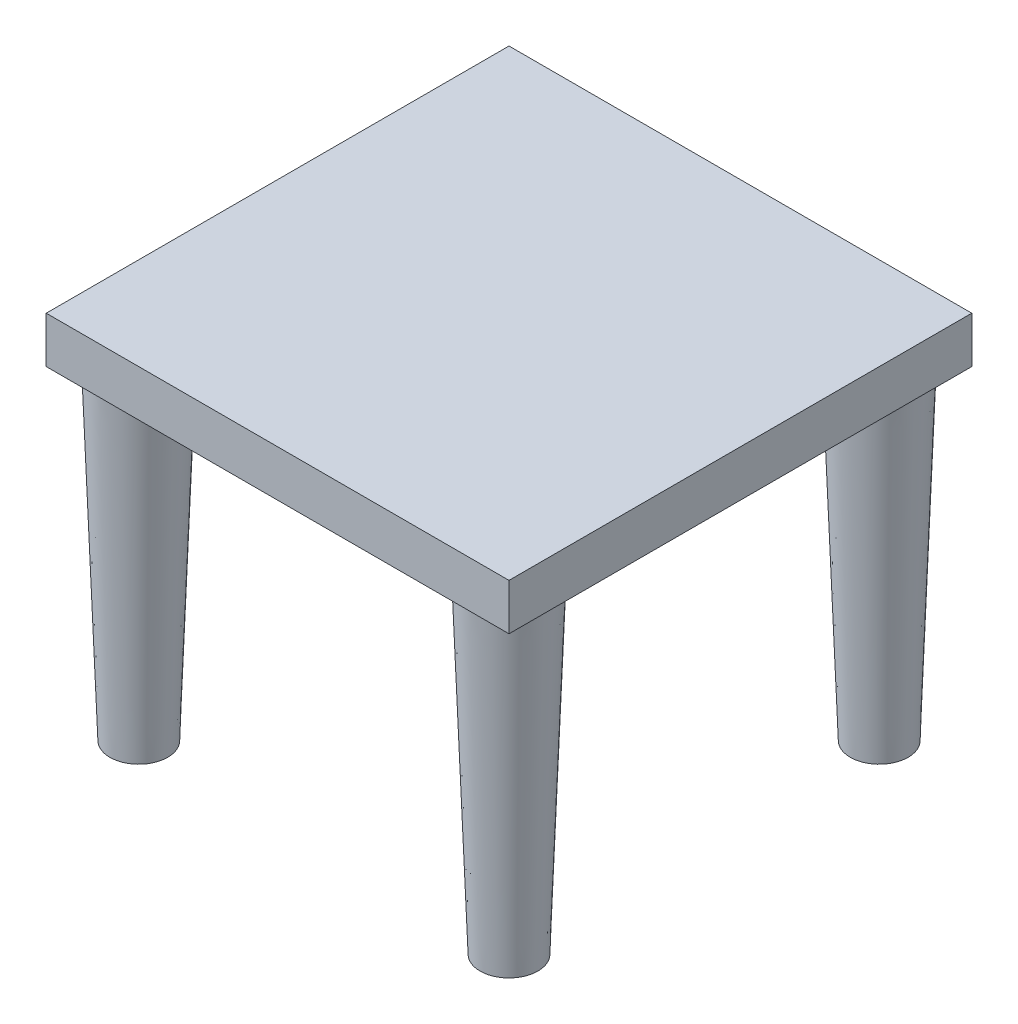
ISO-10303-21;
HEADER;
FILE_DESCRIPTION(('STEP AP214'),'2;1');
FILE_NAME('part.step','',(''),(''),'','','');
FILE_SCHEMA(('AUTOMOTIVE_DESIGN { 1 0 10303 214 1 1 1 1 }'));
ENDSEC;
DATA;
#1=APPLICATION_CONTEXT('core data for automotive mechanical design processes');
#2=APPLICATION_PROTOCOL_DEFINITION('international standard','automotive_design',2000,#1);
#3=PRODUCT_CONTEXT('',#1,'mechanical');
#4=PRODUCT('Part','Part','',(#3));
#5=PRODUCT_RELATED_PRODUCT_CATEGORY('part','',(#4));
#6=PRODUCT_DEFINITION_FORMATION('','',#4);
#7=PRODUCT_DEFINITION_CONTEXT('part definition',#1,'design');
#8=PRODUCT_DEFINITION('design','',#6,#7);
#9=PRODUCT_DEFINITION_SHAPE('','',#8);
#10=(LENGTH_UNIT() NAMED_UNIT(*) SI_UNIT(.MILLI.,.METRE.));
#11=(NAMED_UNIT(*) PLANE_ANGLE_UNIT() SI_UNIT($,.RADIAN.));
#12=(NAMED_UNIT(*) SI_UNIT($,.STERADIAN.) SOLID_ANGLE_UNIT());
#13=UNCERTAINTY_MEASURE_WITH_UNIT(LENGTH_MEASURE(1.E-05),#10,'distance_accuracy_value','');
#14=(GEOMETRIC_REPRESENTATION_CONTEXT(3) GLOBAL_UNCERTAINTY_ASSIGNED_CONTEXT((#13)) GLOBAL_UNIT_ASSIGNED_CONTEXT((#10,
#11,#12)) REPRESENTATION_CONTEXT('',''));
#15=CARTESIAN_POINT('',(0.,0.,0.));
#16=DIRECTION('',(0.,0.,1.));
#17=DIRECTION('',(1.,0.,0.));
#18=AXIS2_PLACEMENT_3D('',#15,#16,#17);
#19=CARTESIAN_POINT('',(50.,5.,-50.));
#20=DIRECTION('',(-1.,0.,0.));
#21=DIRECTION('',(0.,0.,1.));
#22=AXIS2_PLACEMENT_3D('',#19,#20,#21);
#23=PLANE('',#22);
#24=DIRECTION('',(0.,0.,-1.));
#25=VECTOR('',#24,1.);
#26=CARTESIAN_POINT('',(50.,-5.,-50.));
#27=LINE('',#26,#25);
#28=CARTESIAN_POINT('',(50.,-5.,50.));
#29=VERTEX_POINT('',#28);
#30=CARTESIAN_POINT('',(50.,-5.,-50.));
#31=VERTEX_POINT('',#30);
#32=EDGE_CURVE('E115',#29,#31,#27,.T.);
#33=ORIENTED_EDGE('',*,*,#32,.T.);
#34=DIRECTION('',(0.,-1.,0.));
#35=VECTOR('',#34,1.);
#36=CARTESIAN_POINT('',(50.,5.,-50.));
#37=LINE('',#36,#35);
#38=CARTESIAN_POINT('',(50.,5.,-50.));
#39=VERTEX_POINT('',#38);
#40=EDGE_CURVE('E12',#39,#31,#37,.T.);
#41=ORIENTED_EDGE('',*,*,#40,.F.);
#42=DIRECTION('',(0.,0.,-1.));
#43=VECTOR('',#42,1.);
#44=CARTESIAN_POINT('',(50.,5.,-50.));
#45=LINE('',#44,#43);
#46=CARTESIAN_POINT('',(50.,5.,50.));
#47=VERTEX_POINT('',#46);
#48=EDGE_CURVE('E99',#47,#39,#45,.T.);
#49=ORIENTED_EDGE('',*,*,#48,.F.);
#50=DIRECTION('',(0.,-1.,0.));
#51=VECTOR('',#50,1.);
#52=CARTESIAN_POINT('',(50.,5.,50.));
#53=LINE('',#52,#51);
#54=EDGE_CURVE('E111',#47,#29,#53,.T.);
#55=ORIENTED_EDGE('',*,*,#54,.T.);
#56=EDGE_LOOP('',(#33,#41,#49,#55));
#57=FACE_BOUND('',#56,.T.);
#58=ADVANCED_FACE('F47',(#57),#23,.F.);
#59=CARTESIAN_POINT('',(-50.,5.,-50.));
#60=DIRECTION('',(0.,0.,1.));
#61=DIRECTION('',(1.,0.,0.));
#62=AXIS2_PLACEMENT_3D('',#59,#60,#61);
#63=PLANE('',#62);
#64=DIRECTION('',(-1.,0.,0.));
#65=VECTOR('',#64,1.);
#66=CARTESIAN_POINT('',(-50.,-5.,-50.));
#67=LINE('',#66,#65);
#68=CARTESIAN_POINT('',(-50.,-5.,-50.));
#69=VERTEX_POINT('',#68);
#70=EDGE_CURVE('E104',#31,#69,#67,.T.);
#71=ORIENTED_EDGE('',*,*,#70,.T.);
#72=DIRECTION('',(0.,-1.,0.));
#73=VECTOR('',#72,1.);
#74=CARTESIAN_POINT('',(-50.,5.,-50.));
#75=LINE('',#74,#73);
#76=CARTESIAN_POINT('',(-50.,5.,-50.));
#77=VERTEX_POINT('',#76);
#78=EDGE_CURVE('E56',#77,#69,#75,.T.);
#79=ORIENTED_EDGE('',*,*,#78,.F.);
#80=DIRECTION('',(-1.,0.,0.));
#81=VECTOR('',#80,1.);
#82=CARTESIAN_POINT('',(-50.,5.,-50.));
#83=LINE('',#82,#81);
#84=EDGE_CURVE('E94',#39,#77,#83,.T.);
#85=ORIENTED_EDGE('',*,*,#84,.F.);
#86=ORIENTED_EDGE('',*,*,#40,.T.);
#87=EDGE_LOOP('',(#71,#79,#85,#86));
#88=FACE_BOUND('',#87,.T.);
#89=ADVANCED_FACE('F103',(#88),#63,.F.);
#90=CARTESIAN_POINT('',(-50.,5.,-50.));
#91=DIRECTION('',(1.,0.,0.));
#92=DIRECTION('',(0.,0.,-1.));
#93=AXIS2_PLACEMENT_3D('',#90,#91,#92);
#94=PLANE('',#93);
#95=DIRECTION('',(0.,0.,1.));
#96=VECTOR('',#95,1.);
#97=CARTESIAN_POINT('',(-50.,-5.,-50.));
#98=LINE('',#97,#96);
#99=CARTESIAN_POINT('',(-50.,-5.,50.));
#100=VERTEX_POINT('',#99);
#101=EDGE_CURVE('E81',#69,#100,#98,.T.);
#102=ORIENTED_EDGE('',*,*,#101,.T.);
#103=DIRECTION('',(0.,-1.,0.));
#104=VECTOR('',#103,1.);
#105=CARTESIAN_POINT('',(-50.,5.,50.));
#106=LINE('',#105,#104);
#107=CARTESIAN_POINT('',(-50.,5.,50.));
#108=VERTEX_POINT('',#107);
#109=EDGE_CURVE('E106',#108,#100,#106,.T.);
#110=ORIENTED_EDGE('',*,*,#109,.F.);
#111=DIRECTION('',(0.,0.,1.));
#112=VECTOR('',#111,1.);
#113=CARTESIAN_POINT('',(-50.,5.,-50.));
#114=LINE('',#113,#112);
#115=EDGE_CURVE('E97',#77,#108,#114,.T.);
#116=ORIENTED_EDGE('',*,*,#115,.F.);
#117=ORIENTED_EDGE('',*,*,#78,.T.);
#118=EDGE_LOOP('',(#102,#110,#116,#117));
#119=FACE_BOUND('',#118,.T.);
#120=ADVANCED_FACE('F107',(#119),#94,.F.);
#121=CARTESIAN_POINT('',(-50.,5.,50.));
#122=DIRECTION('',(0.,0.,-1.));
#123=DIRECTION('',(-1.,0.,0.));
#124=AXIS2_PLACEMENT_3D('',#121,#122,#123);
#125=PLANE('',#124);
#126=DIRECTION('',(1.,0.,0.));
#127=VECTOR('',#126,1.);
#128=CARTESIAN_POINT('',(-50.,-5.,50.));
#129=LINE('',#128,#127);
#130=EDGE_CURVE('E87',#100,#29,#129,.T.);
#131=ORIENTED_EDGE('',*,*,#130,.T.);
#132=ORIENTED_EDGE('',*,*,#54,.F.);
#133=DIRECTION('',(1.,0.,0.));
#134=VECTOR('',#133,1.);
#135=CARTESIAN_POINT('',(-50.,5.,50.));
#136=LINE('',#135,#134);
#137=EDGE_CURVE('E64',#108,#47,#136,.T.);
#138=ORIENTED_EDGE('',*,*,#137,.F.);
#139=ORIENTED_EDGE('',*,*,#109,.T.);
#140=EDGE_LOOP('',(#131,#132,#138,#139));
#141=FACE_BOUND('',#140,.T.);
#142=ADVANCED_FACE('F129',(#141),#125,.F.);
#143=CARTESIAN_POINT('',(0.,5.,0.));
#144=DIRECTION('',(0.,1.,0.));
#145=DIRECTION('',(0.,0.,1.));
#146=AXIS2_PLACEMENT_3D('',#143,#144,#145);
#147=PLANE('',#146);
#148=ORIENTED_EDGE('',*,*,#48,.T.);
#149=ORIENTED_EDGE('',*,*,#84,.T.);
#150=ORIENTED_EDGE('',*,*,#115,.T.);
#151=ORIENTED_EDGE('',*,*,#137,.T.);
#152=EDGE_LOOP('',(#148,#149,#150,#151));
#153=FACE_BOUND('',#152,.T.);
#154=ADVANCED_FACE('F95',(#153),#147,.T.);
#155=CARTESIAN_POINT('',(0.,-5.,0.));
#156=DIRECTION('',(0.,1.,0.));
#157=DIRECTION('',(0.,0.,1.));
#158=AXIS2_PLACEMENT_3D('',#155,#156,#157);
#159=PLANE('',#158);
#160=CARTESIAN_POINT('',(40.,-5.,-40.));
#161=DIRECTION('',(0.,-1.,0.));
#162=DIRECTION('',(0.,0.,-1.));
#163=AXIS2_PLACEMENT_3D('',#160,#161,#162);
#164=CIRCLE('',#163,8.75);
#165=CARTESIAN_POINT('',(40.,-5.,-48.75));
#166=VERTEX_POINT('',#165);
#167=EDGE_CURVE('E293',#166,#166,#164,.T.);
#168=ORIENTED_EDGE('',*,*,#167,.F.);
#169=EDGE_LOOP('',(#168));
#170=FACE_BOUND('',#169,.T.);
#171=CARTESIAN_POINT('',(40.,-5.,40.));
#172=DIRECTION('',(0.,-1.,0.));
#173=DIRECTION('',(0.,0.,-1.));
#174=AXIS2_PLACEMENT_3D('',#171,#172,#173);
#175=CIRCLE('',#174,8.75);
#176=CARTESIAN_POINT('',(40.,-5.,31.25));
#177=VERTEX_POINT('',#176);
#178=EDGE_CURVE('E314',#177,#177,#175,.T.);
#179=ORIENTED_EDGE('',*,*,#178,.F.);
#180=EDGE_LOOP('',(#179));
#181=FACE_BOUND('',#180,.T.);
#182=CARTESIAN_POINT('',(-40.,-5.,40.));
#183=DIRECTION('',(0.,-1.,0.));
#184=DIRECTION('',(0.,0.,-1.));
#185=AXIS2_PLACEMENT_3D('',#182,#183,#184);
#186=CIRCLE('',#185,8.75);
#187=CARTESIAN_POINT('',(-40.,-5.,31.25));
#188=VERTEX_POINT('',#187);
#189=EDGE_CURVE('E345',#188,#188,#186,.T.);
#190=ORIENTED_EDGE('',*,*,#189,.F.);
#191=EDGE_LOOP('',(#190));
#192=FACE_BOUND('',#191,.T.);
#193=CARTESIAN_POINT('',(-40.,-5.,-40.));
#194=DIRECTION('',(0.,-1.,0.));
#195=DIRECTION('',(0.,0.,-1.));
#196=AXIS2_PLACEMENT_3D('',#193,#194,#195);
#197=CIRCLE('',#196,8.75);
#198=CARTESIAN_POINT('',(-44.3686501676961,-5.,-32.4186151850543));
#199=VERTEX_POINT('',#198);
#200=EDGE_CURVE('E141',#199,#199,#197,.T.);
#201=ORIENTED_EDGE('',*,*,#200,.F.);
#202=EDGE_LOOP('',(#201));
#203=FACE_BOUND('',#202,.T.);
#204=ORIENTED_EDGE('',*,*,#32,.F.);
#205=ORIENTED_EDGE('',*,*,#130,.F.);
#206=ORIENTED_EDGE('',*,*,#101,.F.);
#207=ORIENTED_EDGE('',*,*,#70,.F.);
#208=EDGE_LOOP('',(#204,#205,#206,#207));
#209=FACE_BOUND('',#208,.T.);
#210=ADVANCED_FACE('F132',(#170,#181,#192,#203,#209),#159,.F.);
#211=CARTESIAN_POINT('',(-40.,-75.,-40.));
#212=DIRECTION('',(0.,1.,0.));
#213=DIRECTION('',(0.,0.,1.));
#214=AXIS2_PLACEMENT_3D('',#211,#212,#213);
#215=PLANE('',#214);
#216=CARTESIAN_POINT('',(-40.,-75.,-40.));
#217=DIRECTION('',(0.,1.,0.));
#218=DIRECTION('',(0.,0.,1.));
#219=AXIS2_PLACEMENT_3D('',#216,#217,#218);
#220=CIRCLE('',#219,6.25);
#221=CARTESIAN_POINT('',(-41.9051940872332,-75.,-34.0474597447836));
#222=VERTEX_POINT('',#221);
#223=EDGE_CURVE('E119',#222,#222,#220,.T.);
#224=ORIENTED_EDGE('',*,*,#223,.F.);
#225=EDGE_LOOP('',(#224));
#226=FACE_BOUND('',#225,.T.);
#227=ADVANCED_FACE('F148',(#226),#215,.F.);
#228=CARTESIAN_POINT('',(-44.3686501676961,-5.,-32.4186151850543));
#229=CARTESIAN_POINT('',(-41.9051940872332,-75.,-34.0474597447836));
#230=CARTESIAN_POINT('',(-59.5314197975875,-5.,-41.1559155204464));
#231=CARTESIAN_POINT('',(-53.810274597666,-75.,-37.85784791925));
#232=CARTESIAN_POINT('',(-50.7941194621954,-5.,-56.3186851503378));
#233=CARTESIAN_POINT('',(-49.9998864231996,-75.,-49.7629284296828));
#234=CARTESIAN_POINT('',(-35.631349832304,-5.,-47.5813848149457));
#235=CARTESIAN_POINT('',(-38.0948059127668,-75.,-45.9525402552164));
#236=CARTESIAN_POINT('',(-20.4685802024126,-5.,-38.8440844795536));
#237=CARTESIAN_POINT('',(-26.189725402334,-75.,-42.14215208075));
#238=CARTESIAN_POINT('',(-29.2058805378047,-5.,-23.6813148496622));
#239=CARTESIAN_POINT('',(-30.0001135768004,-75.,-30.2370715703172));
#240=CARTESIAN_POINT('',(-44.3686501676961,-5.,-32.4186151850543));
#241=CARTESIAN_POINT('',(-41.9051940872332,-75.,-34.0474597447836));
#242=(BOUNDED_SURFACE() B_SPLINE_SURFACE(3,1,((#228,#229),(#230,#231),(#232,#233),(#234,#235),
(#236,#237),(#238,#239),(#240,#241)),.UNSPECIFIED.,.T.,.F.,.F.) B_SPLINE_SURFACE_WITH_KNOTS((4,
3,4),(2,2),(0.,0.5,1.),(0.,1.),
.UNSPECIFIED.) GEOMETRIC_REPRESENTATION_ITEM() RATIONAL_B_SPLINE_SURFACE(((1.,1.),
(0.333333333333333,0.333333333333333),(0.333333333333333,0.333333333333333),(1.,1.),
(0.333333333333333,0.333333333333333),(0.333333333333333,0.333333333333333),(1.,1.))) REPRESENTATION_ITEM('') SURFACE());
#243=CARTESIAN_POINT('',(-44.3686501676961,-5.,-32.4186151850543));
#244=CARTESIAN_POINT('',(-44.3429891668579,-5.72916666666667,-32.4355823158848));
#245=CARTESIAN_POINT('',(-44.3173281660197,-6.45833333333333,-32.4525494467153));
#246=CARTESIAN_POINT('',(-44.2660061643434,-7.91666666666667,-32.4864837083764));
#247=CARTESIAN_POINT('',(-44.2403451635053,-8.64583333333333,-32.5034508392069));
#248=CARTESIAN_POINT('',(-44.189023161829,-10.1041666666667,-32.5373851008679));
#249=CARTESIAN_POINT('',(-44.1633621609908,-10.8333333333333,-32.5543522316984));
#250=CARTESIAN_POINT('',(-44.1120401593145,-12.2916666666667,-32.5882864933594));
#251=CARTESIAN_POINT('',(-44.0863791584764,-13.0208333333333,-32.60525362419));
#252=CARTESIAN_POINT('',(-44.0350571568001,-14.4791666666667,-32.639187885851));
#253=CARTESIAN_POINT('',(-44.0093961559619,-15.2083333333333,-32.6561550166815));
#254=CARTESIAN_POINT('',(-43.9580741542856,-16.6666666666667,-32.6900892783425));
#255=CARTESIAN_POINT('',(-43.9324131534474,-17.3958333333333,-32.707056409173));
#256=CARTESIAN_POINT('',(-43.8810911517711,-18.8541666666667,-32.7409906708341));
#257=CARTESIAN_POINT('',(-43.855430150933,-19.5833333333333,-32.7579578016646));
#258=CARTESIAN_POINT('',(-43.8041081492566,-21.0416666666667,-32.7918920633256));
#259=CARTESIAN_POINT('',(-43.7784471484185,-21.7708333333333,-32.8088591941561));
#260=CARTESIAN_POINT('',(-43.7271251467422,-23.2291666666667,-32.8427934558171));
#261=CARTESIAN_POINT('',(-43.701464145904,-23.9583333333333,-32.8597605866477));
#262=CARTESIAN_POINT('',(-43.6501421442277,-25.4166666666667,-32.8936948483087));
#263=CARTESIAN_POINT('',(-43.6244811433896,-26.1458333333333,-32.9106619791392));
#264=CARTESIAN_POINT('',(-43.5731591417133,-27.6041666666667,-32.9445962408002));
#265=CARTESIAN_POINT('',(-43.5474981408751,-28.3333333333333,-32.9615633716307));
#266=CARTESIAN_POINT('',(-43.4961761391988,-29.7916666666667,-32.9954976332918));
#267=CARTESIAN_POINT('',(-43.4705151383606,-30.5208333333333,-33.0124647641223));
#268=CARTESIAN_POINT('',(-43.4191931366843,-31.9791666666667,-33.0463990257833));
#269=CARTESIAN_POINT('',(-43.3935321358462,-32.7083333333333,-33.0633661566138));
#270=CARTESIAN_POINT('',(-43.3422101341699,-34.1666666666667,-33.0973004182748));
#271=CARTESIAN_POINT('',(-43.3165491333317,-34.8958333333333,-33.1142675491054));
#272=CARTESIAN_POINT('',(-43.2652271316554,-36.3541666666667,-33.1482018107664));
#273=CARTESIAN_POINT('',(-43.2395661308172,-37.0833333333333,-33.1651689415969));
#274=CARTESIAN_POINT('',(-43.1882441291409,-38.5416666666667,-33.1991032032579));
#275=CARTESIAN_POINT('',(-43.1625831283028,-39.2708333333333,-33.2160703340884));
#276=CARTESIAN_POINT('',(-43.1112611266265,-40.7291666666667,-33.2500045957495));
#277=CARTESIAN_POINT('',(-43.0856001257883,-41.4583333333333,-33.26697172658));
#278=CARTESIAN_POINT('',(-43.034278124112,-42.9166666666667,-33.300905988241));
#279=CARTESIAN_POINT('',(-43.0086171232739,-43.6458333333333,-33.3178731190715));
#280=CARTESIAN_POINT('',(-42.9572951215976,-45.1041666666667,-33.3518073807326));
#281=CARTESIAN_POINT('',(-42.9316341207594,-45.8333333333333,-33.3687745115631));
#282=CARTESIAN_POINT('',(-42.8803121190831,-47.2916666666667,-33.4027087732241));
#283=CARTESIAN_POINT('',(-42.8546511182449,-48.0208333333333,-33.4196759040546));
#284=CARTESIAN_POINT('',(-42.8033291165686,-49.4791666666667,-33.4536101657156));
#285=CARTESIAN_POINT('',(-42.7776681157305,-50.2083333333333,-33.4705772965462));
#286=CARTESIAN_POINT('',(-42.7263461140542,-51.6666666666667,-33.5045115582072));
#287=CARTESIAN_POINT('',(-42.700685113216,-52.3958333333333,-33.5214786890377));
#288=CARTESIAN_POINT('',(-42.6493631115397,-53.8541666666667,-33.5554129506987));
#289=CARTESIAN_POINT('',(-42.6237021107015,-54.5833333333333,-33.5723800815292));
#290=CARTESIAN_POINT('',(-42.5723801090252,-56.0416666666667,-33.6063143431903));
#291=CARTESIAN_POINT('',(-42.5467191081871,-56.7708333333333,-33.6232814740208));
#292=CARTESIAN_POINT('',(-42.4953971065108,-58.2291666666667,-33.6572157356818));
#293=CARTESIAN_POINT('',(-42.4697361056726,-58.9583333333333,-33.6741828665123));
#294=CARTESIAN_POINT('',(-42.4184141039963,-60.4166666666667,-33.7081171281733));
#295=CARTESIAN_POINT('',(-42.3927531031581,-61.1458333333333,-33.7250842590039));
#296=CARTESIAN_POINT('',(-42.3414311014818,-62.6041666666667,-33.7590185206649));
#297=CARTESIAN_POINT('',(-42.3157701006437,-63.3333333333333,-33.7759856514954));
#298=CARTESIAN_POINT('',(-42.2644480989674,-64.7916666666667,-33.8099199131564));
#299=CARTESIAN_POINT('',(-42.2387870981292,-65.5208333333333,-33.8268870439869));
#300=CARTESIAN_POINT('',(-42.1874650964529,-66.9791666666667,-33.860821305648));
#301=CARTESIAN_POINT('',(-42.1618040956147,-67.7083333333333,-33.8777884364785));
#302=CARTESIAN_POINT('',(-42.1104820939384,-69.1666666666667,-33.9117226981395));
#303=CARTESIAN_POINT('',(-42.0848210931003,-69.8958333333333,-33.92868982897));
#304=CARTESIAN_POINT('',(-42.033499091424,-71.3541666666667,-33.962624090631));
#305=CARTESIAN_POINT('',(-42.0078380905858,-72.0833333333333,-33.9795912214616));
#306=CARTESIAN_POINT('',(-41.9565160889095,-73.5416666666667,-34.0135254831226));
#307=CARTESIAN_POINT('',(-41.9308550880714,-74.2708333333333,-34.0304926139531));
#308=CARTESIAN_POINT('',(-41.9051940872332,-75.,-34.0474597447836));
#309=B_SPLINE_CURVE_WITH_KNOTS('',3,(#243,#244,#245,#246,#247,#248,#249,#250,#251,#252,#253,
#254,#255,#256,#257,#258,#259,#260,#261,#262,#263,#264,#265,#266,#267,#268,#269,#270,#271,#272,
#273,#274,#275,#276,#277,#278,#279,#280,#281,#282,#283,#284,#285,#286,#287,#288,#289,#290,#291,
#292,#293,#294,#295,#296,#297,#298,#299,#300,#301,#302,#303,#304,#305,#306,#307,#308),
.UNSPECIFIED.,.F.,.F.,(4,2,2,2,2,2,2,2,2,2,2,2,2,2,2,2,2,2,2,2,2,2,2,2,2,2,2,2,2,2,2,2,4),(0.,
2.18944595375947,4.37889190751894,6.56833786127841,8.75778381503788,10.9472297687974,
13.1366757225568,15.3261216763163,17.5155676300758,19.7050135838352,21.8944595375947,
24.0839054913542,26.2733514451136,28.4627973988731,30.6522433526326,32.8416893063921,
35.0311352601515,37.220581213911,39.4100271676705,41.5994731214299,43.7889190751894,
45.9783650289489,48.1678109827084,50.3572569364678,52.5467028902273,54.7361488439868,
56.9255947977462,59.1150407515057,61.3044867052652,63.4939326590246,65.6833786127841,
67.8728245665436,70.0622705203031),.UNSPECIFIED.);
#310=EDGE_CURVE('BSEAM158',#199,#222,#309,.T.);
#311=ORIENTED_EDGE('',*,*,#200,.T.);
#312=ORIENTED_EDGE('',*,*,#223,.T.);
#313=ORIENTED_EDGE('',*,*,#310,.T.);
#314=ORIENTED_EDGE('',*,*,#310,.F.);
#315=EDGE_LOOP('',(#311,#313,#312,#314));
#316=FACE_BOUND('',#315,.T.);
#317=ADVANCED_FACE('F158',(#316),#242,.T.);
#318=CARTESIAN_POINT('',(-40.,-75.,40.));
#319=DIRECTION('',(0.,1.,0.));
#320=DIRECTION('',(0.,0.,1.));
#321=AXIS2_PLACEMENT_3D('',#318,#319,#320);
#322=PLANE('',#321);
#323=CARTESIAN_POINT('',(-40.,-75.,40.));
#324=DIRECTION('',(0.,1.,0.));
#325=DIRECTION('',(0.,0.,1.));
#326=AXIS2_PLACEMENT_3D('',#323,#324,#325);
#327=CIRCLE('',#326,6.25);
#328=CARTESIAN_POINT('',(-40.,-75.,46.25));
#329=VERTEX_POINT('',#328);
#330=EDGE_CURVE('E352',#329,#329,#327,.T.);
#331=ORIENTED_EDGE('',*,*,#330,.F.);
#332=EDGE_LOOP('',(#331));
#333=FACE_BOUND('',#332,.T.);
#334=ADVANCED_FACE('F216',(#333),#322,.F.);
#335=CARTESIAN_POINT('',(-40.,-75.,40.));
#336=DIRECTION('',(0.,1.,0.));
#337=DIRECTION('',(0.,0.,1.));
#338=AXIS2_PLACEMENT_3D('',#335,#336,#337);
#339=CONICAL_SURFACE('',#338,6.25,0.035699112679324);
#340=ORIENTED_EDGE('',*,*,#189,.T.);
#341=EDGE_LOOP('',(#340));
#342=FACE_BOUND('',#341,.T.);
#343=ORIENTED_EDGE('',*,*,#330,.T.);
#344=EDGE_LOOP('',(#343));
#345=FACE_BOUND('',#344,.T.);
#346=ADVANCED_FACE('F225',(#342,#345),#339,.T.);
#347=CARTESIAN_POINT('',(40.,-75.,40.));
#348=DIRECTION('',(0.,1.,0.));
#349=DIRECTION('',(0.,0.,1.));
#350=AXIS2_PLACEMENT_3D('',#347,#348,#349);
#351=PLANE('',#350);
#352=CARTESIAN_POINT('',(40.,-75.,40.));
#353=DIRECTION('',(0.,1.,0.));
#354=DIRECTION('',(0.,0.,1.));
#355=AXIS2_PLACEMENT_3D('',#352,#353,#354);
#356=CIRCLE('',#355,6.25);
#357=CARTESIAN_POINT('',(40.,-75.,46.25));
#358=VERTEX_POINT('',#357);
#359=EDGE_CURVE('E321',#358,#358,#356,.T.);
#360=ORIENTED_EDGE('',*,*,#359,.F.);
#361=EDGE_LOOP('',(#360));
#362=FACE_BOUND('',#361,.T.);
#363=ADVANCED_FACE('F234',(#362),#351,.F.);
#364=CARTESIAN_POINT('',(40.,-75.,40.));
#365=DIRECTION('',(0.,1.,0.));
#366=DIRECTION('',(0.,0.,1.));
#367=AXIS2_PLACEMENT_3D('',#364,#365,#366);
#368=CONICAL_SURFACE('',#367,6.25,0.035699112679324);
#369=ORIENTED_EDGE('',*,*,#178,.T.);
#370=EDGE_LOOP('',(#369));
#371=FACE_BOUND('',#370,.T.);
#372=ORIENTED_EDGE('',*,*,#359,.T.);
#373=EDGE_LOOP('',(#372));
#374=FACE_BOUND('',#373,.T.);
#375=ADVANCED_FACE('F244',(#371,#374),#368,.T.);
#376=CARTESIAN_POINT('',(40.,-75.,-40.));
#377=DIRECTION('',(0.,1.,0.));
#378=DIRECTION('',(0.,0.,1.));
#379=AXIS2_PLACEMENT_3D('',#376,#377,#378);
#380=PLANE('',#379);
#381=CARTESIAN_POINT('',(40.,-75.,-40.));
#382=DIRECTION('',(0.,1.,0.));
#383=DIRECTION('',(0.,0.,1.));
#384=AXIS2_PLACEMENT_3D('',#381,#382,#383);
#385=CIRCLE('',#384,6.25);
#386=CARTESIAN_POINT('',(40.,-75.,-33.75));
#387=VERTEX_POINT('',#386);
#388=EDGE_CURVE('E301',#387,#387,#385,.T.);
#389=ORIENTED_EDGE('',*,*,#388,.F.);
#390=EDGE_LOOP('',(#389));
#391=FACE_BOUND('',#390,.T.);
#392=ADVANCED_FACE('F254',(#391),#380,.F.);
#393=CARTESIAN_POINT('',(40.,-75.,-40.));
#394=DIRECTION('',(0.,1.,0.));
#395=DIRECTION('',(0.,0.,1.));
#396=AXIS2_PLACEMENT_3D('',#393,#394,#395);
#397=CONICAL_SURFACE('',#396,6.25,0.035699112679324);
#398=ORIENTED_EDGE('',*,*,#167,.T.);
#399=EDGE_LOOP('',(#398));
#400=FACE_BOUND('',#399,.T.);
#401=ORIENTED_EDGE('',*,*,#388,.T.);
#402=EDGE_LOOP('',(#401));
#403=FACE_BOUND('',#402,.T.);
#404=ADVANCED_FACE('F269',(#400,#403),#397,.T.);
#405=CLOSED_SHELL('',(#58,#89,#120,#142,#154,#210,#227,#317,#334,#346,#363,#375,#392,#404));
#406=MANIFOLD_SOLID_BREP('B2',#405);
#407=ADVANCED_BREP_SHAPE_REPRESENTATION('',(#18,#406),#14);
#408=SHAPE_DEFINITION_REPRESENTATION(#9,#407);
ENDSEC;
END-ISO-10303-21;
